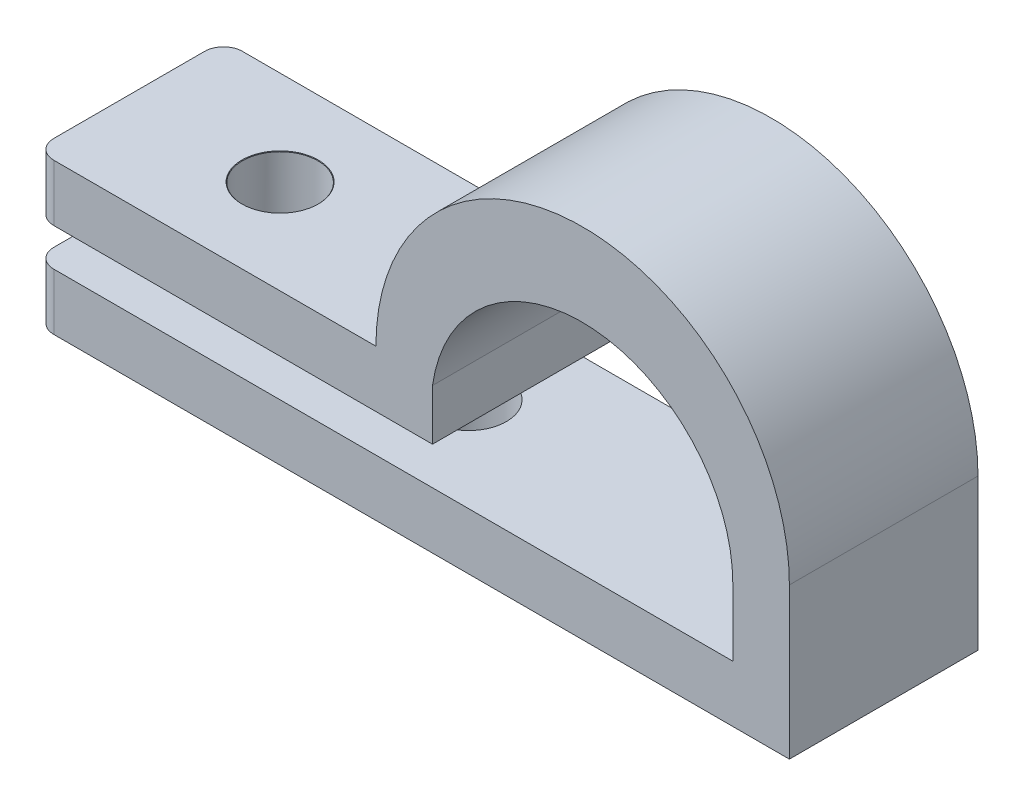
ISO-10303-21;
HEADER;
FILE_DESCRIPTION(('STEP AP214'),'2;1');
FILE_NAME('part.step','',(''),(''),'','','');
FILE_SCHEMA(('AUTOMOTIVE_DESIGN { 1 0 10303 214 1 1 1 1 }'));
ENDSEC;
DATA;
#1=APPLICATION_CONTEXT('core data for automotive mechanical design processes');
#2=APPLICATION_PROTOCOL_DEFINITION('international standard','automotive_design',2000,#1);
#3=PRODUCT_CONTEXT('',#1,'mechanical');
#4=PRODUCT('Part','Part','',(#3));
#5=PRODUCT_RELATED_PRODUCT_CATEGORY('part','',(#4));
#6=PRODUCT_DEFINITION_FORMATION('','',#4);
#7=PRODUCT_DEFINITION_CONTEXT('part definition',#1,'design');
#8=PRODUCT_DEFINITION('design','',#6,#7);
#9=PRODUCT_DEFINITION_SHAPE('','',#8);
#10=(LENGTH_UNIT() NAMED_UNIT(*) SI_UNIT(.MILLI.,.METRE.));
#11=(NAMED_UNIT(*) PLANE_ANGLE_UNIT() SI_UNIT($,.RADIAN.));
#12=(NAMED_UNIT(*) SI_UNIT($,.STERADIAN.) SOLID_ANGLE_UNIT());
#13=UNCERTAINTY_MEASURE_WITH_UNIT(LENGTH_MEASURE(1.E-05),#10,'distance_accuracy_value','');
#14=(GEOMETRIC_REPRESENTATION_CONTEXT(3) GLOBAL_UNCERTAINTY_ASSIGNED_CONTEXT((#13)) GLOBAL_UNIT_ASSIGNED_CONTEXT((#10,
#11,#12)) REPRESENTATION_CONTEXT('',''));
#15=CARTESIAN_POINT('',(0.,0.,0.));
#16=DIRECTION('',(0.,0.,1.));
#17=DIRECTION('',(1.,0.,0.));
#18=AXIS2_PLACEMENT_3D('',#15,#16,#17);
#19=CARTESIAN_POINT('',(0.,0.,-5.));
#20=DIRECTION('',(-1.,0.,0.));
#21=DIRECTION('',(0.,0.,1.));
#22=AXIS2_PLACEMENT_3D('',#19,#20,#21);
#23=PLANE('',#22);
#24=DIRECTION('',(0.,0.,1.));
#25=VECTOR('',#24,1.);
#26=CARTESIAN_POINT('',(0.,0.,-5.));
#27=LINE('',#26,#25);
#28=CARTESIAN_POINT('',(0.,0.,-4.));
#29=VERTEX_POINT('',#28);
#30=CARTESIAN_POINT('',(0.,0.,4.));
#31=VERTEX_POINT('',#30);
#32=EDGE_CURVE('E178',#29,#31,#27,.T.);
#33=ORIENTED_EDGE('',*,*,#32,.T.);
#34=DIRECTION('',(0.,-1.,0.));
#35=VECTOR('',#34,1.);
#36=CARTESIAN_POINT('',(0.,3.,4.));
#37=LINE('',#36,#35);
#38=CARTESIAN_POINT('',(0.,3.,4.));
#39=VERTEX_POINT('',#38);
#40=EDGE_CURVE('E196',#31,#39,#37,.F.);
#41=ORIENTED_EDGE('',*,*,#40,.T.);
#42=DIRECTION('',(0.,0.,1.));
#43=VECTOR('',#42,1.);
#44=CARTESIAN_POINT('',(0.,3.,-5.));
#45=LINE('',#44,#43);
#46=CARTESIAN_POINT('',(0.,3.,-4.));
#47=VERTEX_POINT('',#46);
#48=EDGE_CURVE('E186',#47,#39,#45,.T.);
#49=ORIENTED_EDGE('',*,*,#48,.F.);
#50=DIRECTION('',(0.,-1.,0.));
#51=VECTOR('',#50,1.);
#52=CARTESIAN_POINT('',(0.,0.,-4.));
#53=LINE('',#52,#51);
#54=EDGE_CURVE('E193',#47,#29,#53,.T.);
#55=ORIENTED_EDGE('',*,*,#54,.T.);
#56=EDGE_LOOP('',(#33,#41,#49,#55));
#57=FACE_BOUND('',#56,.T.);
#58=ADVANCED_FACE('F33',(#57),#23,.T.);
#59=CARTESIAN_POINT('',(0.,3.,-5.));
#60=DIRECTION('',(0.,1.,0.));
#61=DIRECTION('',(0.,0.,1.));
#62=AXIS2_PLACEMENT_3D('',#59,#60,#61);
#63=PLANE('',#62);
#64=CARTESIAN_POINT('',(8.,3.,0.));
#65=DIRECTION('',(0.,1.,0.));
#66=DIRECTION('',(0.,0.,1.));
#67=AXIS2_PLACEMENT_3D('',#64,#65,#66);
#68=CIRCLE('',#67,2.);
#69=CARTESIAN_POINT('',(8.,3.,2.));
#70=VERTEX_POINT('',#69);
#71=EDGE_CURVE('E150',#70,#70,#68,.T.);
#72=ORIENTED_EDGE('',*,*,#71,.F.);
#73=EDGE_LOOP('',(#72));
#74=FACE_BOUND('',#73,.T.);
#75=CARTESIAN_POINT('',(18.,3.,0.));
#76=DIRECTION('',(0.,1.,0.));
#77=DIRECTION('',(0.,0.,1.));
#78=AXIS2_PLACEMENT_3D('',#75,#76,#77);
#79=CIRCLE('',#78,2.);
#80=CARTESIAN_POINT('',(18.,3.,2.));
#81=VERTEX_POINT('',#80);
#82=EDGE_CURVE('E37',#81,#81,#79,.T.);
#83=ORIENTED_EDGE('',*,*,#82,.F.);
#84=EDGE_LOOP('',(#83));
#85=FACE_BOUND('',#84,.T.);
#86=ORIENTED_EDGE('',*,*,#48,.T.);
#87=CARTESIAN_POINT('',(1.,3.,4.));
#88=DIRECTION('',(0.,1.,0.));
#89=DIRECTION('',(0.,0.,1.));
#90=AXIS2_PLACEMENT_3D('',#87,#88,#89);
#91=CIRCLE('',#90,1.);
#92=CARTESIAN_POINT('',(1.,3.,5.));
#93=VERTEX_POINT('',#92);
#94=EDGE_CURVE('E200',#39,#93,#91,.T.);
#95=ORIENTED_EDGE('',*,*,#94,.T.);
#96=DIRECTION('',(-1.,0.,0.));
#97=VECTOR('',#96,1.);
#98=CARTESIAN_POINT('',(0.,3.,5.));
#99=LINE('',#98,#97);
#100=CARTESIAN_POINT('',(37.,3.,5.));
#101=VERTEX_POINT('',#100);
#102=EDGE_CURVE('E272',#101,#93,#99,.T.);
#103=ORIENTED_EDGE('',*,*,#102,.F.);
#104=DIRECTION('',(0.,0.,1.));
#105=VECTOR('',#104,1.);
#106=CARTESIAN_POINT('',(37.,3.,-5.));
#107=LINE('',#106,#105);
#108=CARTESIAN_POINT('',(37.,3.,-5.));
#109=VERTEX_POINT('',#108);
#110=EDGE_CURVE('E246',#109,#101,#107,.T.);
#111=ORIENTED_EDGE('',*,*,#110,.F.);
#112=DIRECTION('',(-1.,0.,0.));
#113=VECTOR('',#112,1.);
#114=CARTESIAN_POINT('',(0.,3.,-5.));
#115=LINE('',#114,#113);
#116=CARTESIAN_POINT('',(1.,3.,-5.));
#117=VERTEX_POINT('',#116);
#118=EDGE_CURVE('E181',#109,#117,#115,.T.);
#119=ORIENTED_EDGE('',*,*,#118,.T.);
#120=CARTESIAN_POINT('',(1.,3.,-4.));
#121=DIRECTION('',(0.,1.,0.));
#122=DIRECTION('',(0.,0.,1.));
#123=AXIS2_PLACEMENT_3D('',#120,#121,#122);
#124=CIRCLE('',#123,1.);
#125=EDGE_CURVE('E198',#117,#47,#124,.T.);
#126=ORIENTED_EDGE('',*,*,#125,.T.);
#127=EDGE_LOOP('',(#86,#95,#103,#111,#119,#126));
#128=FACE_BOUND('',#127,.T.);
#129=ADVANCED_FACE('F324',(#74,#85,#128),#63,.T.);
#130=CARTESIAN_POINT('',(37.,3.,-5.));
#131=DIRECTION('',(-1.,0.,0.));
#132=DIRECTION('',(0.,-1.,0.));
#133=AXIS2_PLACEMENT_3D('',#130,#131,#132);
#134=PLANE('',#133);
#135=ORIENTED_EDGE('',*,*,#110,.T.);
#136=DIRECTION('',(0.,-1.,0.));
#137=VECTOR('',#136,1.);
#138=CARTESIAN_POINT('',(37.,3.,5.));
#139=LINE('',#138,#137);
#140=CARTESIAN_POINT('',(37.,6.57337005023585,5.));
#141=VERTEX_POINT('',#140);
#142=EDGE_CURVE('E274',#141,#101,#139,.T.);
#143=ORIENTED_EDGE('',*,*,#142,.F.);
#144=DIRECTION('',(0.,0.,1.));
#145=VECTOR('',#144,1.);
#146=CARTESIAN_POINT('',(37.,6.57337005023585,-5.));
#147=LINE('',#146,#145);
#148=CARTESIAN_POINT('',(37.,6.57337005023585,-5.));
#149=VERTEX_POINT('',#148);
#150=EDGE_CURVE('E244',#149,#141,#147,.T.);
#151=ORIENTED_EDGE('',*,*,#150,.F.);
#152=DIRECTION('',(0.,-1.,0.));
#153=VECTOR('',#152,1.);
#154=CARTESIAN_POINT('',(37.,3.,-5.));
#155=LINE('',#154,#153);
#156=EDGE_CURVE('E252',#149,#109,#155,.T.);
#157=ORIENTED_EDGE('',*,*,#156,.T.);
#158=EDGE_LOOP('',(#135,#143,#151,#157));
#159=FACE_BOUND('',#158,.T.);
#160=ADVANCED_FACE('F330',(#159),#134,.T.);
#161=CARTESIAN_POINT('',(29.,6.57337005023585,-5.));
#162=DIRECTION('',(0.,0.,1.));
#163=DIRECTION('',(1.,0.,0.));
#164=AXIS2_PLACEMENT_3D('',#161,#162,#163);
#165=CYLINDRICAL_SURFACE('',#164,8.);
#166=ORIENTED_EDGE('',*,*,#150,.T.);
#167=CARTESIAN_POINT('',(29.,6.57337005023585,5.));
#168=DIRECTION('',(0.,0.,-1.));
#169=DIRECTION('',(-1.,0.,0.));
#170=AXIS2_PLACEMENT_3D('',#167,#168,#169);
#171=CIRCLE('',#170,8.);
#172=CARTESIAN_POINT('',(21.0790855730698,7.69547282683365,5.));
#173=VERTEX_POINT('',#172);
#174=EDGE_CURVE('E277',#173,#141,#171,.T.);
#175=ORIENTED_EDGE('',*,*,#174,.F.);
#176=DIRECTION('',(0.,0.,1.));
#177=VECTOR('',#176,1.);
#178=CARTESIAN_POINT('',(21.0790855730698,7.69547282683365,-5.));
#179=LINE('',#178,#177);
#180=CARTESIAN_POINT('',(21.0790855730698,7.69547282683365,-5.));
#181=VERTEX_POINT('',#180);
#182=EDGE_CURVE('E240',#181,#173,#179,.T.);
#183=ORIENTED_EDGE('',*,*,#182,.F.);
#184=CARTESIAN_POINT('',(29.,6.57337005023585,-5.));
#185=DIRECTION('',(0.,0.,-1.));
#186=DIRECTION('',(-1.,0.,0.));
#187=AXIS2_PLACEMENT_3D('',#184,#185,#186);
#188=CIRCLE('',#187,8.);
#189=EDGE_CURVE('E255',#181,#149,#188,.T.);
#190=ORIENTED_EDGE('',*,*,#189,.T.);
#191=EDGE_LOOP('',(#166,#175,#183,#190));
#192=FACE_BOUND('',#191,.T.);
#193=ADVANCED_FACE('F382',(#192),#165,.F.);
#194=CARTESIAN_POINT('',(21.0790855730698,5.,-5.));
#195=DIRECTION('',(1.,0.,0.));
#196=DIRECTION('',(0.,0.,-1.));
#197=AXIS2_PLACEMENT_3D('',#194,#195,#196);
#198=PLANE('',#197);
#199=ORIENTED_EDGE('',*,*,#182,.T.);
#200=DIRECTION('',(0.,1.,0.));
#201=VECTOR('',#200,1.);
#202=CARTESIAN_POINT('',(21.0790855730698,5.,5.));
#203=LINE('',#202,#201);
#204=CARTESIAN_POINT('',(21.0790855730698,5.,5.));
#205=VERTEX_POINT('',#204);
#206=EDGE_CURVE('E280',#205,#173,#203,.T.);
#207=ORIENTED_EDGE('',*,*,#206,.F.);
#208=DIRECTION('',(0.,0.,1.));
#209=VECTOR('',#208,1.);
#210=CARTESIAN_POINT('',(21.0790855730698,5.,-5.));
#211=LINE('',#210,#209);
#212=CARTESIAN_POINT('',(21.0790855730698,5.,-5.));
#213=VERTEX_POINT('',#212);
#214=EDGE_CURVE('E239',#213,#205,#211,.T.);
#215=ORIENTED_EDGE('',*,*,#214,.F.);
#216=DIRECTION('',(0.,1.,0.));
#217=VECTOR('',#216,1.);
#218=CARTESIAN_POINT('',(21.0790855730698,5.,-5.));
#219=LINE('',#218,#217);
#220=EDGE_CURVE('E258',#213,#181,#219,.T.);
#221=ORIENTED_EDGE('',*,*,#220,.T.);
#222=EDGE_LOOP('',(#199,#207,#215,#221));
#223=FACE_BOUND('',#222,.T.);
#224=ADVANCED_FACE('F379',(#223),#198,.T.);
#225=CARTESIAN_POINT('',(0.,5.,-5.));
#226=DIRECTION('',(0.,-1.,0.));
#227=DIRECTION('',(0.,0.,-1.));
#228=AXIS2_PLACEMENT_3D('',#225,#226,#227);
#229=PLANE('',#228);
#230=CARTESIAN_POINT('',(8.,5.,0.));
#231=DIRECTION('',(0.,-1.,0.));
#232=DIRECTION('',(0.,0.,-1.));
#233=AXIS2_PLACEMENT_3D('',#230,#231,#232);
#234=CIRCLE('',#233,2.);
#235=CARTESIAN_POINT('',(8.,5.,-2.));
#236=VERTEX_POINT('',#235);
#237=EDGE_CURVE('E299',#236,#236,#234,.T.);
#238=ORIENTED_EDGE('',*,*,#237,.F.);
#239=EDGE_LOOP('',(#238));
#240=FACE_BOUND('',#239,.T.);
#241=CARTESIAN_POINT('',(18.,5.,0.));
#242=DIRECTION('',(0.,-1.,0.));
#243=DIRECTION('',(0.,0.,-1.));
#244=AXIS2_PLACEMENT_3D('',#241,#242,#243);
#245=CIRCLE('',#244,2.);
#246=CARTESIAN_POINT('',(18.,5.,-2.));
#247=VERTEX_POINT('',#246);
#248=EDGE_CURVE('E289',#247,#247,#245,.T.);
#249=ORIENTED_EDGE('',*,*,#248,.F.);
#250=EDGE_LOOP('',(#249));
#251=FACE_BOUND('',#250,.T.);
#252=DIRECTION('',(1.,0.,0.));
#253=VECTOR('',#252,1.);
#254=CARTESIAN_POINT('',(0.,5.,5.));
#255=LINE('',#254,#253);
#256=CARTESIAN_POINT('',(1.,5.,5.));
#257=VERTEX_POINT('',#256);
#258=EDGE_CURVE('E227',#257,#205,#255,.T.);
#259=ORIENTED_EDGE('',*,*,#258,.F.);
#260=CARTESIAN_POINT('',(1.,5.,4.));
#261=DIRECTION('',(0.,-1.,0.));
#262=DIRECTION('',(0.,0.,-1.));
#263=AXIS2_PLACEMENT_3D('',#260,#261,#262);
#264=CIRCLE('',#263,1.);
#265=CARTESIAN_POINT('',(0.,5.,4.));
#266=VERTEX_POINT('',#265);
#267=EDGE_CURVE('E204',#257,#266,#264,.T.);
#268=ORIENTED_EDGE('',*,*,#267,.T.);
#269=DIRECTION('',(0.,0.,1.));
#270=VECTOR('',#269,1.);
#271=CARTESIAN_POINT('',(0.,5.,-5.));
#272=LINE('',#271,#270);
#273=CARTESIAN_POINT('',(0.,5.,-4.));
#274=VERTEX_POINT('',#273);
#275=EDGE_CURVE('E234',#274,#266,#272,.T.);
#276=ORIENTED_EDGE('',*,*,#275,.F.);
#277=CARTESIAN_POINT('',(1.,5.,-4.));
#278=DIRECTION('',(0.,-1.,0.));
#279=DIRECTION('',(0.,0.,-1.));
#280=AXIS2_PLACEMENT_3D('',#277,#278,#279);
#281=CIRCLE('',#280,1.);
#282=CARTESIAN_POINT('',(1.,5.,-5.));
#283=VERTEX_POINT('',#282);
#284=EDGE_CURVE('E202',#274,#283,#281,.T.);
#285=ORIENTED_EDGE('',*,*,#284,.T.);
#286=DIRECTION('',(1.,0.,0.));
#287=VECTOR('',#286,1.);
#288=CARTESIAN_POINT('',(0.,5.,-5.));
#289=LINE('',#288,#287);
#290=EDGE_CURVE('E261',#283,#213,#289,.T.);
#291=ORIENTED_EDGE('',*,*,#290,.T.);
#292=ORIENTED_EDGE('',*,*,#214,.T.);
#293=EDGE_LOOP('',(#259,#268,#276,#285,#291,#292));
#294=FACE_BOUND('',#293,.T.);
#295=ADVANCED_FACE('F233',(#240,#251,#294),#229,.T.);
#296=CARTESIAN_POINT('',(0.,5.,-5.));
#297=DIRECTION('',(-1.,0.,0.));
#298=DIRECTION('',(0.,0.,1.));
#299=AXIS2_PLACEMENT_3D('',#296,#297,#298);
#300=PLANE('',#299);
#301=ORIENTED_EDGE('',*,*,#275,.T.);
#302=DIRECTION('',(0.,-1.,0.));
#303=VECTOR('',#302,1.);
#304=CARTESIAN_POINT('',(0.,8.,4.));
#305=LINE('',#304,#303);
#306=CARTESIAN_POINT('',(0.,8.,4.));
#307=VERTEX_POINT('',#306);
#308=EDGE_CURVE('E209',#266,#307,#305,.F.);
#309=ORIENTED_EDGE('',*,*,#308,.T.);
#310=DIRECTION('',(0.,0.,1.));
#311=VECTOR('',#310,1.);
#312=CARTESIAN_POINT('',(0.,8.,-5.));
#313=LINE('',#312,#311);
#314=CARTESIAN_POINT('',(0.,8.,-4.));
#315=VERTEX_POINT('',#314);
#316=EDGE_CURVE('E170',#315,#307,#313,.T.);
#317=ORIENTED_EDGE('',*,*,#316,.F.);
#318=DIRECTION('',(0.,-1.,0.));
#319=VECTOR('',#318,1.);
#320=CARTESIAN_POINT('',(0.,5.,-4.));
#321=LINE('',#320,#319);
#322=EDGE_CURVE('E206',#315,#274,#321,.T.);
#323=ORIENTED_EDGE('',*,*,#322,.T.);
#324=EDGE_LOOP('',(#301,#309,#317,#323));
#325=FACE_BOUND('',#324,.T.);
#326=ADVANCED_FACE('F237',(#325),#300,.T.);
#327=CARTESIAN_POINT('',(0.,8.,-5.));
#328=DIRECTION('',(0.,1.,0.));
#329=DIRECTION('',(0.,0.,1.));
#330=AXIS2_PLACEMENT_3D('',#327,#328,#329);
#331=PLANE('',#330);
#332=CARTESIAN_POINT('',(8.,8.,0.));
#333=DIRECTION('',(0.,1.,0.));
#334=DIRECTION('',(0.,0.,1.));
#335=AXIS2_PLACEMENT_3D('',#332,#333,#334);
#336=CIRCLE('',#335,2.025);
#337=CARTESIAN_POINT('',(8.,8.,2.025));
#338=VERTEX_POINT('',#337);
#339=EDGE_CURVE('E308',#338,#338,#336,.T.);
#340=ORIENTED_EDGE('',*,*,#339,.F.);
#341=EDGE_LOOP('',(#340));
#342=FACE_BOUND('',#341,.T.);
#343=CARTESIAN_POINT('',(18.,8.,0.));
#344=DIRECTION('',(0.,1.,0.));
#345=DIRECTION('',(0.,0.,1.));
#346=AXIS2_PLACEMENT_3D('',#343,#344,#345);
#347=CIRCLE('',#346,2.025);
#348=CARTESIAN_POINT('',(18.0790855730698,8.,-2.0234550828057));
#349=VERTEX_POINT('',#348);
#350=CARTESIAN_POINT('',(18.0790855730698,8.,2.0234550828057));
#351=VERTEX_POINT('',#350);
#352=EDGE_CURVE('E145',#349,#351,#347,.T.);
#353=ORIENTED_EDGE('',*,*,#352,.F.);
#354=DIRECTION('',(0.,0.,1.));
#355=VECTOR('',#354,1.);
#356=CARTESIAN_POINT('',(18.0790855730698,8.,-5.));
#357=LINE('',#356,#355);
#358=CARTESIAN_POINT('',(18.0790855730698,8.,-5.));
#359=VERTEX_POINT('',#358);
#360=EDGE_CURVE('E167',#359,#349,#357,.T.);
#361=ORIENTED_EDGE('',*,*,#360,.F.);
#362=DIRECTION('',(-1.,0.,0.));
#363=VECTOR('',#362,1.);
#364=CARTESIAN_POINT('',(0.,8.,-5.));
#365=LINE('',#364,#363);
#366=CARTESIAN_POINT('',(1.,8.,-5.));
#367=VERTEX_POINT('',#366);
#368=EDGE_CURVE('E263',#359,#367,#365,.T.);
#369=ORIENTED_EDGE('',*,*,#368,.T.);
#370=CARTESIAN_POINT('',(1.,8.,-4.));
#371=DIRECTION('',(0.,1.,0.));
#372=DIRECTION('',(0.,0.,1.));
#373=AXIS2_PLACEMENT_3D('',#370,#371,#372);
#374=CIRCLE('',#373,1.);
#375=EDGE_CURVE('E211',#367,#315,#374,.T.);
#376=ORIENTED_EDGE('',*,*,#375,.T.);
#377=ORIENTED_EDGE('',*,*,#316,.T.);
#378=CARTESIAN_POINT('',(1.,8.,4.));
#379=DIRECTION('',(0.,1.,0.));
#380=DIRECTION('',(0.,0.,1.));
#381=AXIS2_PLACEMENT_3D('',#378,#379,#380);
#382=CIRCLE('',#381,1.);
#383=CARTESIAN_POINT('',(1.,8.,5.));
#384=VERTEX_POINT('',#383);
#385=EDGE_CURVE('E213',#307,#384,#382,.T.);
#386=ORIENTED_EDGE('',*,*,#385,.T.);
#387=DIRECTION('',(-1.,0.,0.));
#388=VECTOR('',#387,1.);
#389=CARTESIAN_POINT('',(0.,8.,5.));
#390=LINE('',#389,#388);
#391=CARTESIAN_POINT('',(18.0790855730698,8.,5.));
#392=VERTEX_POINT('',#391);
#393=EDGE_CURVE('E161',#392,#384,#390,.T.);
#394=ORIENTED_EDGE('',*,*,#393,.F.);
#395=EDGE_CURVE('E158',#351,#392,#357,.T.);
#396=ORIENTED_EDGE('',*,*,#395,.F.);
#397=EDGE_LOOP('',(#353,#361,#369,#376,#377,#386,#394,#396));
#398=FACE_BOUND('',#397,.T.);
#399=ADVANCED_FACE('F159',(#342,#398),#331,.T.);
#400=CARTESIAN_POINT('',(29.0395427865349,8.,-5.));
#401=DIRECTION('',(0.,0.,1.));
#402=DIRECTION('',(1.,0.,0.));
#403=AXIS2_PLACEMENT_3D('',#400,#401,#402);
#404=CYLINDRICAL_SURFACE('',#403,10.9604572134651);
#405=ORIENTED_EDGE('',*,*,#360,.T.);
#406=EDGE_CURVE('E155',#349,#351,#357,.T.);
#407=ORIENTED_EDGE('',*,*,#406,.T.);
#408=ORIENTED_EDGE('',*,*,#395,.T.);
#409=CARTESIAN_POINT('',(29.0395427865349,8.,5.));
#410=DIRECTION('',(0.,0.,1.));
#411=DIRECTION('',(1.,0.,0.));
#412=AXIS2_PLACEMENT_3D('',#409,#410,#411);
#413=CIRCLE('',#412,10.9604572134651);
#414=CARTESIAN_POINT('',(40.,8.,5.));
#415=VERTEX_POINT('',#414);
#416=EDGE_CURVE('E226',#415,#392,#413,.T.);
#417=ORIENTED_EDGE('',*,*,#416,.F.);
#418=DIRECTION('',(0.,0.,1.));
#419=VECTOR('',#418,1.);
#420=CARTESIAN_POINT('',(40.,8.,-5.));
#421=LINE('',#420,#419);
#422=CARTESIAN_POINT('',(40.,8.,-5.));
#423=VERTEX_POINT('',#422);
#424=EDGE_CURVE('E165',#423,#415,#421,.T.);
#425=ORIENTED_EDGE('',*,*,#424,.F.);
#426=CARTESIAN_POINT('',(29.0395427865349,8.,-5.));
#427=DIRECTION('',(0.,0.,1.));
#428=DIRECTION('',(1.,0.,0.));
#429=AXIS2_PLACEMENT_3D('',#426,#427,#428);
#430=CIRCLE('',#429,10.9604572134651);
#431=EDGE_CURVE('E265',#423,#359,#430,.T.);
#432=ORIENTED_EDGE('',*,*,#431,.T.);
#433=EDGE_LOOP('',(#405,#407,#408,#417,#425,#432));
#434=FACE_BOUND('',#433,.T.);
#435=ADVANCED_FACE('F168',(#434),#404,.T.);
#436=CARTESIAN_POINT('',(40.,0.,-5.));
#437=DIRECTION('',(1.,0.,0.));
#438=DIRECTION('',(0.,0.,-1.));
#439=AXIS2_PLACEMENT_3D('',#436,#437,#438);
#440=PLANE('',#439);
#441=ORIENTED_EDGE('',*,*,#424,.T.);
#442=DIRECTION('',(0.,1.,0.));
#443=VECTOR('',#442,1.);
#444=CARTESIAN_POINT('',(40.,0.,5.));
#445=LINE('',#444,#443);
#446=CARTESIAN_POINT('',(40.,0.,5.));
#447=VERTEX_POINT('',#446);
#448=EDGE_CURVE('E285',#447,#415,#445,.T.);
#449=ORIENTED_EDGE('',*,*,#448,.F.);
#450=DIRECTION('',(0.,0.,1.));
#451=VECTOR('',#450,1.);
#452=CARTESIAN_POINT('',(40.,0.,-5.));
#453=LINE('',#452,#451);
#454=CARTESIAN_POINT('',(40.,0.,-5.));
#455=VERTEX_POINT('',#454);
#456=EDGE_CURVE('E175',#455,#447,#453,.T.);
#457=ORIENTED_EDGE('',*,*,#456,.F.);
#458=DIRECTION('',(0.,1.,0.));
#459=VECTOR('',#458,1.);
#460=CARTESIAN_POINT('',(40.,0.,-5.));
#461=LINE('',#460,#459);
#462=EDGE_CURVE('E267',#455,#423,#461,.T.);
#463=ORIENTED_EDGE('',*,*,#462,.T.);
#464=EDGE_LOOP('',(#441,#449,#457,#463));
#465=FACE_BOUND('',#464,.T.);
#466=ADVANCED_FACE('F320',(#465),#440,.T.);
#467=CARTESIAN_POINT('',(0.,0.,-5.));
#468=DIRECTION('',(0.,-1.,0.));
#469=DIRECTION('',(0.,0.,-1.));
#470=AXIS2_PLACEMENT_3D('',#467,#468,#469);
#471=PLANE('',#470);
#472=CARTESIAN_POINT('',(8.,0.,0.));
#473=DIRECTION('',(0.,1.,0.));
#474=DIRECTION('',(0.,0.,1.));
#475=AXIS2_PLACEMENT_3D('',#472,#473,#474);
#476=CIRCLE('',#475,2.);
#477=CARTESIAN_POINT('',(8.,0.,2.));
#478=VERTEX_POINT('',#477);
#479=EDGE_CURVE('E302',#478,#478,#476,.T.);
#480=ORIENTED_EDGE('',*,*,#479,.T.);
#481=EDGE_LOOP('',(#480));
#482=FACE_BOUND('',#481,.T.);
#483=CARTESIAN_POINT('',(18.,0.,0.));
#484=DIRECTION('',(0.,1.,0.));
#485=DIRECTION('',(0.,0.,1.));
#486=AXIS2_PLACEMENT_3D('',#483,#484,#485);
#487=CIRCLE('',#486,2.);
#488=CARTESIAN_POINT('',(18.,0.,2.));
#489=VERTEX_POINT('',#488);
#490=EDGE_CURVE('E292',#489,#489,#487,.T.);
#491=ORIENTED_EDGE('',*,*,#490,.T.);
#492=EDGE_LOOP('',(#491));
#493=FACE_BOUND('',#492,.T.);
#494=DIRECTION('',(1.,0.,0.));
#495=VECTOR('',#494,1.);
#496=CARTESIAN_POINT('',(0.,0.,5.));
#497=LINE('',#496,#495);
#498=CARTESIAN_POINT('',(1.,0.,5.));
#499=VERTEX_POINT('',#498);
#500=EDGE_CURVE('E287',#499,#447,#497,.T.);
#501=ORIENTED_EDGE('',*,*,#500,.F.);
#502=CARTESIAN_POINT('',(1.,0.,4.));
#503=DIRECTION('',(0.,-1.,0.));
#504=DIRECTION('',(0.,0.,-1.));
#505=AXIS2_PLACEMENT_3D('',#502,#503,#504);
#506=CIRCLE('',#505,1.);
#507=EDGE_CURVE('E191',#499,#31,#506,.T.);
#508=ORIENTED_EDGE('',*,*,#507,.T.);
#509=ORIENTED_EDGE('',*,*,#32,.F.);
#510=CARTESIAN_POINT('',(1.,0.,-4.));
#511=DIRECTION('',(0.,-1.,0.));
#512=DIRECTION('',(0.,0.,-1.));
#513=AXIS2_PLACEMENT_3D('',#510,#511,#512);
#514=CIRCLE('',#513,1.);
#515=CARTESIAN_POINT('',(1.,0.,-5.));
#516=VERTEX_POINT('',#515);
#517=EDGE_CURVE('E189',#29,#516,#514,.T.);
#518=ORIENTED_EDGE('',*,*,#517,.T.);
#519=DIRECTION('',(1.,0.,0.));
#520=VECTOR('',#519,1.);
#521=CARTESIAN_POINT('',(0.,0.,-5.));
#522=LINE('',#521,#520);
#523=EDGE_CURVE('E270',#516,#455,#522,.T.);
#524=ORIENTED_EDGE('',*,*,#523,.T.);
#525=ORIENTED_EDGE('',*,*,#456,.T.);
#526=EDGE_LOOP('',(#501,#508,#509,#518,#524,#525));
#527=FACE_BOUND('',#526,.T.);
#528=ADVANCED_FACE('F335',(#482,#493,#527),#471,.T.);
#529=CARTESIAN_POINT('',(29.,6.57337005023585,-5.));
#530=DIRECTION('',(0.,0.,-1.));
#531=DIRECTION('',(-1.,0.,0.));
#532=AXIS2_PLACEMENT_3D('',#529,#530,#531);
#533=PLANE('',#532);
#534=ORIENTED_EDGE('',*,*,#523,.F.);
#535=DIRECTION('',(0.,-1.,0.));
#536=VECTOR('',#535,1.);
#537=CARTESIAN_POINT('',(1.,6.57337005023585,-5.));
#538=LINE('',#537,#536);
#539=EDGE_CURVE('E11',#516,#117,#538,.F.);
#540=ORIENTED_EDGE('',*,*,#539,.T.);
#541=ORIENTED_EDGE('',*,*,#118,.F.);
#542=ORIENTED_EDGE('',*,*,#156,.F.);
#543=ORIENTED_EDGE('',*,*,#189,.F.);
#544=ORIENTED_EDGE('',*,*,#220,.F.);
#545=ORIENTED_EDGE('',*,*,#290,.F.);
#546=DIRECTION('',(0.,-1.,0.));
#547=VECTOR('',#546,1.);
#548=CARTESIAN_POINT('',(1.,6.57337005023585,-5.));
#549=LINE('',#548,#547);
#550=EDGE_CURVE('E42',#283,#367,#549,.F.);
#551=ORIENTED_EDGE('',*,*,#550,.T.);
#552=ORIENTED_EDGE('',*,*,#368,.F.);
#553=ORIENTED_EDGE('',*,*,#431,.F.);
#554=ORIENTED_EDGE('',*,*,#462,.F.);
#555=EDGE_LOOP('',(#534,#540,#541,#542,#543,#544,#545,#551,#552,#553,#554));
#556=FACE_BOUND('',#555,.T.);
#557=ADVANCED_FACE('F368',(#556),#533,.T.);
#558=CARTESIAN_POINT('',(29.,6.57337005023585,5.));
#559=DIRECTION('',(0.,0.,-1.));
#560=DIRECTION('',(-1.,0.,0.));
#561=AXIS2_PLACEMENT_3D('',#558,#559,#560);
#562=PLANE('',#561);
#563=ORIENTED_EDGE('',*,*,#102,.T.);
#564=DIRECTION('',(0.,-1.,0.));
#565=VECTOR('',#564,1.);
#566=CARTESIAN_POINT('',(1.,0.,5.));
#567=LINE('',#566,#565);
#568=EDGE_CURVE('E185',#93,#499,#567,.T.);
#569=ORIENTED_EDGE('',*,*,#568,.T.);
#570=ORIENTED_EDGE('',*,*,#500,.T.);
#571=ORIENTED_EDGE('',*,*,#448,.T.);
#572=ORIENTED_EDGE('',*,*,#416,.T.);
#573=ORIENTED_EDGE('',*,*,#393,.T.);
#574=DIRECTION('',(0.,-1.,0.));
#575=VECTOR('',#574,1.);
#576=CARTESIAN_POINT('',(1.,5.,5.));
#577=LINE('',#576,#575);
#578=EDGE_CURVE('E182',#384,#257,#577,.T.);
#579=ORIENTED_EDGE('',*,*,#578,.T.);
#580=ORIENTED_EDGE('',*,*,#258,.T.);
#581=ORIENTED_EDGE('',*,*,#206,.T.);
#582=ORIENTED_EDGE('',*,*,#174,.T.);
#583=ORIENTED_EDGE('',*,*,#142,.T.);
#584=EDGE_LOOP('',(#563,#569,#570,#571,#572,#573,#579,#580,#581,#582,#583));
#585=FACE_BOUND('',#584,.T.);
#586=ADVANCED_FACE('F223',(#585),#562,.F.);
#587=CARTESIAN_POINT('',(1.,6.57337005023585,4.));
#588=DIRECTION('',(0.,1.,0.));
#589=DIRECTION('',(0.,0.,1.));
#590=AXIS2_PLACEMENT_3D('',#587,#588,#589);
#591=CYLINDRICAL_SURFACE('',#590,1.);
#592=ORIENTED_EDGE('',*,*,#94,.F.);
#593=ORIENTED_EDGE('',*,*,#40,.F.);
#594=ORIENTED_EDGE('',*,*,#507,.F.);
#595=ORIENTED_EDGE('',*,*,#568,.F.);
#596=EDGE_LOOP('',(#592,#593,#594,#595));
#597=FACE_BOUND('',#596,.T.);
#598=ADVANCED_FACE('F337',(#597),#591,.T.);
#599=CARTESIAN_POINT('',(1.,6.57337005023585,4.));
#600=DIRECTION('',(0.,1.,0.));
#601=DIRECTION('',(0.,0.,1.));
#602=AXIS2_PLACEMENT_3D('',#599,#600,#601);
#603=CYLINDRICAL_SURFACE('',#602,1.);
#604=ORIENTED_EDGE('',*,*,#385,.F.);
#605=ORIENTED_EDGE('',*,*,#308,.F.);
#606=ORIENTED_EDGE('',*,*,#267,.F.);
#607=ORIENTED_EDGE('',*,*,#578,.F.);
#608=EDGE_LOOP('',(#604,#605,#606,#607));
#609=FACE_BOUND('',#608,.T.);
#610=ADVANCED_FACE('F229',(#609),#603,.T.);
#611=CARTESIAN_POINT('',(1.,0.,-4.));
#612=DIRECTION('',(0.,-1.,0.));
#613=DIRECTION('',(0.,0.,-1.));
#614=AXIS2_PLACEMENT_3D('',#611,#612,#613);
#615=CYLINDRICAL_SURFACE('',#614,1.);
#616=ORIENTED_EDGE('',*,*,#125,.F.);
#617=ORIENTED_EDGE('',*,*,#539,.F.);
#618=ORIENTED_EDGE('',*,*,#517,.F.);
#619=ORIENTED_EDGE('',*,*,#54,.F.);
#620=EDGE_LOOP('',(#616,#617,#618,#619));
#621=FACE_BOUND('',#620,.T.);
#622=ADVANCED_FACE('F342',(#621),#615,.T.);
#623=CARTESIAN_POINT('',(1.,5.,-4.));
#624=DIRECTION('',(0.,-1.,0.));
#625=DIRECTION('',(0.,0.,-1.));
#626=AXIS2_PLACEMENT_3D('',#623,#624,#625);
#627=CYLINDRICAL_SURFACE('',#626,1.);
#628=ORIENTED_EDGE('',*,*,#375,.F.);
#629=ORIENTED_EDGE('',*,*,#550,.F.);
#630=ORIENTED_EDGE('',*,*,#284,.F.);
#631=ORIENTED_EDGE('',*,*,#322,.F.);
#632=EDGE_LOOP('',(#628,#629,#630,#631));
#633=FACE_BOUND('',#632,.T.);
#634=ADVANCED_FACE('F35',(#633),#627,.T.);
#635=CARTESIAN_POINT('',(18.,8.,0.));
#636=DIRECTION('',(0.,1.,0.));
#637=DIRECTION('',(0.,0.,1.));
#638=AXIS2_PLACEMENT_3D('',#635,#636,#637);
#639=CYLINDRICAL_SURFACE('',#638,2.);
#640=ORIENTED_EDGE('',*,*,#82,.T.);
#641=EDGE_LOOP('',(#640));
#642=FACE_BOUND('',#641,.T.);
#643=ORIENTED_EDGE('',*,*,#490,.F.);
#644=EDGE_LOOP('',(#643));
#645=FACE_BOUND('',#644,.T.);
#646=ADVANCED_FACE('F348',(#642,#645),#639,.F.);
#647=ORIENTED_EDGE('',*,*,#248,.T.);
#648=EDGE_LOOP('',(#647));
#649=FACE_BOUND('',#648,.T.);
#650=CARTESIAN_POINT('',(18.,7.975,0.));
#651=DIRECTION('',(0.,1.,0.));
#652=DIRECTION('',(0.,0.,1.));
#653=AXIS2_PLACEMENT_3D('',#650,#651,#652);
#654=CIRCLE('',#653,2.);
#655=CARTESIAN_POINT('',(18.,7.975,2.));
#656=VERTEX_POINT('',#655);
#657=EDGE_CURVE('E156',#656,#656,#654,.T.);
#658=ORIENTED_EDGE('',*,*,#657,.T.);
#659=EDGE_LOOP('',(#658));
#660=FACE_BOUND('',#659,.T.);
#661=ADVANCED_FACE('F400',(#649,#660),#639,.F.);
#662=CARTESIAN_POINT('',(20.025,8.,0.));
#663=DIRECTION('',(0.,1.,0.));
#664=DIRECTION('',(0.,0.,1.));
#665=AXIS2_PLACEMENT_3D('',#662,#663,#664);
#666=PLANE('',#665);
#667=ORIENTED_EDGE('',*,*,#406,.F.);
#668=EDGE_CURVE('E48',#351,#349,#347,.T.);
#669=ORIENTED_EDGE('',*,*,#668,.F.);
#670=EDGE_LOOP('',(#667,#669));
#671=FACE_BOUND('',#670,.T.);
#672=ADVANCED_FACE('F153',(#671),#666,.F.);
#673=CARTESIAN_POINT('',(18.,8.,0.));
#674=DIRECTION('',(0.,1.,0.));
#675=DIRECTION('',(0.,0.,1.));
#676=AXIS2_PLACEMENT_3D('',#673,#674,#675);
#677=CONICAL_SURFACE('',#676,2.025,0.785398163397448);
#678=ORIENTED_EDGE('',*,*,#657,.F.);
#679=EDGE_LOOP('',(#678));
#680=FACE_BOUND('',#679,.T.);
#681=ORIENTED_EDGE('',*,*,#668,.T.);
#682=ORIENTED_EDGE('',*,*,#352,.T.);
#683=EDGE_LOOP('',(#681,#682));
#684=FACE_BOUND('',#683,.T.);
#685=ADVANCED_FACE('F146',(#680,#684),#677,.F.);
#686=CARTESIAN_POINT('',(8.,8.,0.));
#687=DIRECTION('',(0.,1.,0.));
#688=DIRECTION('',(0.,0.,1.));
#689=AXIS2_PLACEMENT_3D('',#686,#687,#688);
#690=CYLINDRICAL_SURFACE('',#689,2.);
#691=ORIENTED_EDGE('',*,*,#71,.T.);
#692=EDGE_LOOP('',(#691));
#693=FACE_BOUND('',#692,.T.);
#694=ORIENTED_EDGE('',*,*,#479,.F.);
#695=EDGE_LOOP('',(#694));
#696=FACE_BOUND('',#695,.T.);
#697=ADVANCED_FACE('F407',(#693,#696),#690,.F.);
#698=ORIENTED_EDGE('',*,*,#237,.T.);
#699=EDGE_LOOP('',(#698));
#700=FACE_BOUND('',#699,.T.);
#701=CARTESIAN_POINT('',(8.,7.975,0.));
#702=DIRECTION('',(0.,1.,0.));
#703=DIRECTION('',(0.,0.,1.));
#704=AXIS2_PLACEMENT_3D('',#701,#702,#703);
#705=CIRCLE('',#704,2.);
#706=CARTESIAN_POINT('',(8.,7.975,2.));
#707=VERTEX_POINT('',#706);
#708=EDGE_CURVE('E305',#707,#707,#705,.T.);
#709=ORIENTED_EDGE('',*,*,#708,.T.);
#710=EDGE_LOOP('',(#709));
#711=FACE_BOUND('',#710,.T.);
#712=ADVANCED_FACE('F413',(#700,#711),#690,.F.);
#713=CARTESIAN_POINT('',(8.,8.,0.));
#714=DIRECTION('',(0.,1.,0.));
#715=DIRECTION('',(0.,0.,1.));
#716=AXIS2_PLACEMENT_3D('',#713,#714,#715);
#717=CONICAL_SURFACE('',#716,2.025,0.785398163397448);
#718=ORIENTED_EDGE('',*,*,#708,.F.);
#719=EDGE_LOOP('',(#718));
#720=FACE_BOUND('',#719,.T.);
#721=ORIENTED_EDGE('',*,*,#339,.T.);
#722=EDGE_LOOP('',(#721));
#723=FACE_BOUND('',#722,.T.);
#724=ADVANCED_FACE('F312',(#720,#723),#717,.F.);
#725=CLOSED_SHELL('',(#58,#129,#160,#193,#224,#295,#326,#399,#435,#466,#528,#557,#586,#598,#610,
#622,#634,#646,#661,#672,#685,#697,#712,#724));
#726=MANIFOLD_SOLID_BREP('B2',#725);
#727=ADVANCED_BREP_SHAPE_REPRESENTATION('',(#18,#726),#14);
#728=SHAPE_DEFINITION_REPRESENTATION(#9,#727);
ENDSEC;
END-ISO-10303-21;
